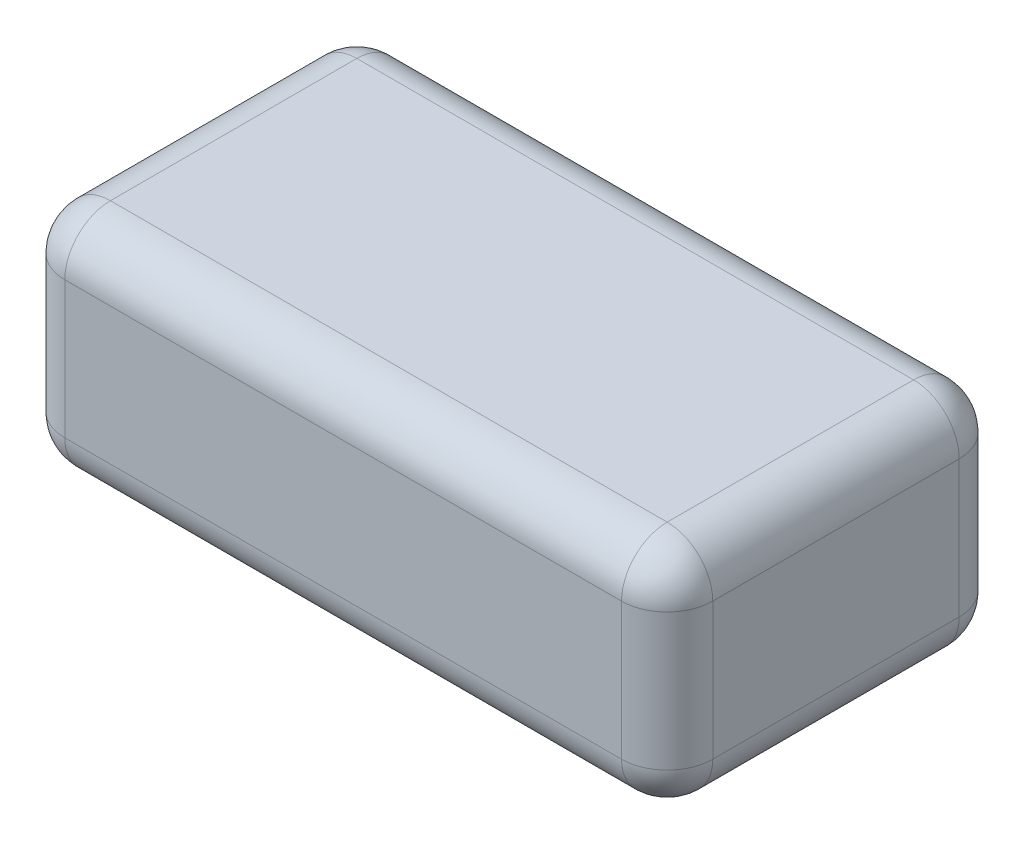
ISO-10303-21;
HEADER;
FILE_DESCRIPTION(('STEP AP214'),'2;1');
FILE_NAME('part.step','',(''),(''),'','','');
FILE_SCHEMA(('AUTOMOTIVE_DESIGN { 1 0 10303 214 1 1 1 1 }'));
ENDSEC;
DATA;
#1=APPLICATION_CONTEXT('core data for automotive mechanical design processes');
#2=APPLICATION_PROTOCOL_DEFINITION('international standard','automotive_design',2000,#1);
#3=PRODUCT_CONTEXT('',#1,'mechanical');
#4=PRODUCT('Part','Part','',(#3));
#5=PRODUCT_RELATED_PRODUCT_CATEGORY('part','',(#4));
#6=PRODUCT_DEFINITION_FORMATION('','',#4);
#7=PRODUCT_DEFINITION_CONTEXT('part definition',#1,'design');
#8=PRODUCT_DEFINITION('design','',#6,#7);
#9=PRODUCT_DEFINITION_SHAPE('','',#8);
#10=(LENGTH_UNIT() NAMED_UNIT(*) SI_UNIT(.MILLI.,.METRE.));
#11=(NAMED_UNIT(*) PLANE_ANGLE_UNIT() SI_UNIT($,.RADIAN.));
#12=(NAMED_UNIT(*) SI_UNIT($,.STERADIAN.) SOLID_ANGLE_UNIT());
#13=UNCERTAINTY_MEASURE_WITH_UNIT(LENGTH_MEASURE(1.E-05),#10,'distance_accuracy_value','');
#14=(GEOMETRIC_REPRESENTATION_CONTEXT(3) GLOBAL_UNCERTAINTY_ASSIGNED_CONTEXT((#13)) GLOBAL_UNIT_ASSIGNED_CONTEXT((#10,
#11,#12)) REPRESENTATION_CONTEXT('',''));
#15=CARTESIAN_POINT('',(0.,0.,0.));
#16=DIRECTION('',(0.,0.,1.));
#17=DIRECTION('',(1.,0.,0.));
#18=AXIS2_PLACEMENT_3D('',#15,#16,#17);
#19=CARTESIAN_POINT('',(35.5,25.,18.5));
#20=DIRECTION('',(-1.,0.,0.));
#21=DIRECTION('',(0.,0.,1.));
#22=AXIS2_PLACEMENT_3D('',#19,#20,#21);
#23=PLANE('',#22);
#24=DIRECTION('',(0.,0.,-1.));
#25=VECTOR('',#24,1.);
#26=CARTESIAN_POINT('',(35.5,20.,18.5));
#27=LINE('',#26,#25);
#28=CARTESIAN_POINT('',(35.5,20.,-13.5));
#29=VERTEX_POINT('',#28);
#30=CARTESIAN_POINT('',(35.5,20.,13.5));
#31=VERTEX_POINT('',#30);
#32=EDGE_CURVE('E175',#29,#31,#27,.F.);
#33=ORIENTED_EDGE('',*,*,#32,.T.);
#34=DIRECTION('',(0.,-1.,0.));
#35=VECTOR('',#34,1.);
#36=CARTESIAN_POINT('',(35.5,25.,13.5));
#37=LINE('',#36,#35);
#38=CARTESIAN_POINT('',(35.5,5.,13.5));
#39=VERTEX_POINT('',#38);
#40=EDGE_CURVE('E179',#31,#39,#37,.T.);
#41=ORIENTED_EDGE('',*,*,#40,.T.);
#42=DIRECTION('',(0.,0.,-1.));
#43=VECTOR('',#42,1.);
#44=CARTESIAN_POINT('',(35.5,5.,-18.5));
#45=LINE('',#44,#43);
#46=CARTESIAN_POINT('',(35.5,5.,-13.5));
#47=VERTEX_POINT('',#46);
#48=EDGE_CURVE('E177',#39,#47,#45,.T.);
#49=ORIENTED_EDGE('',*,*,#48,.T.);
#50=DIRECTION('',(0.,-1.,0.));
#51=VECTOR('',#50,1.);
#52=CARTESIAN_POINT('',(35.5,25.,-13.5));
#53=LINE('',#52,#51);
#54=EDGE_CURVE('E173',#47,#29,#53,.F.);
#55=ORIENTED_EDGE('',*,*,#54,.T.);
#56=EDGE_LOOP('',(#33,#41,#49,#55));
#57=FACE_BOUND('',#56,.T.);
#58=ADVANCED_FACE('F32',(#57),#23,.F.);
#59=CARTESIAN_POINT('',(-35.5,25.,-18.5));
#60=DIRECTION('',(0.,0.,1.));
#61=DIRECTION('',(1.,0.,0.));
#62=AXIS2_PLACEMENT_3D('',#59,#60,#61);
#63=PLANE('',#62);
#64=DIRECTION('',(-1.,0.,0.));
#65=VECTOR('',#64,1.);
#66=CARTESIAN_POINT('',(-35.5,20.,-18.5));
#67=LINE('',#66,#65);
#68=CARTESIAN_POINT('',(-30.5,20.,-18.5));
#69=VERTEX_POINT('',#68);
#70=CARTESIAN_POINT('',(30.5,20.,-18.5));
#71=VERTEX_POINT('',#70);
#72=EDGE_CURVE('E41',#69,#71,#67,.F.);
#73=ORIENTED_EDGE('',*,*,#72,.T.);
#74=DIRECTION('',(0.,-1.,0.));
#75=VECTOR('',#74,1.);
#76=CARTESIAN_POINT('',(30.5,25.,-18.5));
#77=LINE('',#76,#75);
#78=CARTESIAN_POINT('',(30.5,5.,-18.5));
#79=VERTEX_POINT('',#78);
#80=EDGE_CURVE('E11',#71,#79,#77,.T.);
#81=ORIENTED_EDGE('',*,*,#80,.T.);
#82=DIRECTION('',(-1.,0.,0.));
#83=VECTOR('',#82,1.);
#84=CARTESIAN_POINT('',(-35.5,5.,-18.5));
#85=LINE('',#84,#83);
#86=CARTESIAN_POINT('',(-30.5,5.,-18.5));
#87=VERTEX_POINT('',#86);
#88=EDGE_CURVE('E198',#79,#87,#85,.T.);
#89=ORIENTED_EDGE('',*,*,#88,.T.);
#90=DIRECTION('',(0.,-1.,0.));
#91=VECTOR('',#90,1.);
#92=CARTESIAN_POINT('',(-30.5,25.,-18.5));
#93=LINE('',#92,#91);
#94=EDGE_CURVE('E52',#87,#69,#93,.F.);
#95=ORIENTED_EDGE('',*,*,#94,.T.);
#96=EDGE_LOOP('',(#73,#81,#89,#95));
#97=FACE_BOUND('',#96,.T.);
#98=ADVANCED_FACE('F270',(#97),#63,.F.);
#99=CARTESIAN_POINT('',(-35.5,25.,18.5));
#100=DIRECTION('',(1.,0.,0.));
#101=DIRECTION('',(0.,0.,-1.));
#102=AXIS2_PLACEMENT_3D('',#99,#100,#101);
#103=PLANE('',#102);
#104=DIRECTION('',(0.,-1.,0.));
#105=VECTOR('',#104,1.);
#106=CARTESIAN_POINT('',(-35.5,25.,13.5));
#107=LINE('',#106,#105);
#108=CARTESIAN_POINT('',(-35.5,5.,13.5));
#109=VERTEX_POINT('',#108);
#110=CARTESIAN_POINT('',(-35.5,20.,13.5));
#111=VERTEX_POINT('',#110);
#112=EDGE_CURVE('E193',#109,#111,#107,.F.);
#113=ORIENTED_EDGE('',*,*,#112,.T.);
#114=DIRECTION('',(0.,0.,1.));
#115=VECTOR('',#114,1.);
#116=CARTESIAN_POINT('',(-35.5,20.,18.5));
#117=LINE('',#116,#115);
#118=CARTESIAN_POINT('',(-35.5,20.,-13.5));
#119=VERTEX_POINT('',#118);
#120=EDGE_CURVE('E195',#111,#119,#117,.F.);
#121=ORIENTED_EDGE('',*,*,#120,.T.);
#122=DIRECTION('',(0.,-1.,0.));
#123=VECTOR('',#122,1.);
#124=CARTESIAN_POINT('',(-35.5,25.,-13.5));
#125=LINE('',#124,#123);
#126=CARTESIAN_POINT('',(-35.5,5.,-13.5));
#127=VERTEX_POINT('',#126);
#128=EDGE_CURVE('E189',#119,#127,#125,.T.);
#129=ORIENTED_EDGE('',*,*,#128,.T.);
#130=DIRECTION('',(0.,0.,1.));
#131=VECTOR('',#130,1.);
#132=CARTESIAN_POINT('',(-35.5,5.,18.5));
#133=LINE('',#132,#131);
#134=EDGE_CURVE('E191',#127,#109,#133,.T.);
#135=ORIENTED_EDGE('',*,*,#134,.T.);
#136=EDGE_LOOP('',(#113,#121,#129,#135));
#137=FACE_BOUND('',#136,.T.);
#138=ADVANCED_FACE('F289',(#137),#103,.F.);
#139=CARTESIAN_POINT('',(-35.5,25.,18.5));
#140=DIRECTION('',(0.,0.,-1.));
#141=DIRECTION('',(-1.,0.,0.));
#142=AXIS2_PLACEMENT_3D('',#139,#140,#141);
#143=PLANE('',#142);
#144=DIRECTION('',(0.,-1.,0.));
#145=VECTOR('',#144,1.);
#146=CARTESIAN_POINT('',(-30.5,25.,18.5));
#147=LINE('',#146,#145);
#148=CARTESIAN_POINT('',(-30.5,20.,18.5));
#149=VERTEX_POINT('',#148);
#150=CARTESIAN_POINT('',(-30.5,5.,18.5));
#151=VERTEX_POINT('',#150);
#152=EDGE_CURVE('E124',#149,#151,#147,.T.);
#153=ORIENTED_EDGE('',*,*,#152,.T.);
#154=DIRECTION('',(1.,0.,0.));
#155=VECTOR('',#154,1.);
#156=CARTESIAN_POINT('',(35.5,5.,18.5));
#157=LINE('',#156,#155);
#158=CARTESIAN_POINT('',(30.5,5.,18.5));
#159=VERTEX_POINT('',#158);
#160=EDGE_CURVE('E162',#151,#159,#157,.T.);
#161=ORIENTED_EDGE('',*,*,#160,.T.);
#162=DIRECTION('',(0.,-1.,0.));
#163=VECTOR('',#162,1.);
#164=CARTESIAN_POINT('',(30.5,25.,18.5));
#165=LINE('',#164,#163);
#166=CARTESIAN_POINT('',(30.5,20.,18.5));
#167=VERTEX_POINT('',#166);
#168=EDGE_CURVE('E127',#159,#167,#165,.F.);
#169=ORIENTED_EDGE('',*,*,#168,.T.);
#170=DIRECTION('',(1.,0.,0.));
#171=VECTOR('',#170,1.);
#172=CARTESIAN_POINT('',(-35.5,20.,18.5));
#173=LINE('',#172,#171);
#174=EDGE_CURVE('E119',#167,#149,#173,.F.);
#175=ORIENTED_EDGE('',*,*,#174,.T.);
#176=EDGE_LOOP('',(#153,#161,#169,#175));
#177=FACE_BOUND('',#176,.T.);
#178=ADVANCED_FACE('F121',(#177),#143,.F.);
#179=CARTESIAN_POINT('',(0.,25.,0.));
#180=DIRECTION('',(0.,-1.,0.));
#181=DIRECTION('',(0.,0.,-1.));
#182=AXIS2_PLACEMENT_3D('',#179,#180,#181);
#183=PLANE('',#182);
#184=DIRECTION('',(0.,0.,1.));
#185=VECTOR('',#184,1.);
#186=CARTESIAN_POINT('',(-30.5,25.,0.));
#187=LINE('',#186,#185);
#188=CARTESIAN_POINT('',(-30.5,25.,-13.5));
#189=VERTEX_POINT('',#188);
#190=CARTESIAN_POINT('',(-30.5,25.,13.5));
#191=VERTEX_POINT('',#190);
#192=EDGE_CURVE('E184',#189,#191,#187,.T.);
#193=ORIENTED_EDGE('',*,*,#192,.T.);
#194=DIRECTION('',(1.,0.,0.));
#195=VECTOR('',#194,1.);
#196=CARTESIAN_POINT('',(0.,25.,13.5));
#197=LINE('',#196,#195);
#198=CARTESIAN_POINT('',(30.5,25.,13.5));
#199=VERTEX_POINT('',#198);
#200=EDGE_CURVE('E138',#191,#199,#197,.T.);
#201=ORIENTED_EDGE('',*,*,#200,.T.);
#202=DIRECTION('',(0.,0.,-1.));
#203=VECTOR('',#202,1.);
#204=CARTESIAN_POINT('',(30.5,25.,0.));
#205=LINE('',#204,#203);
#206=CARTESIAN_POINT('',(30.5,25.,-13.5));
#207=VERTEX_POINT('',#206);
#208=EDGE_CURVE('E186',#199,#207,#205,.T.);
#209=ORIENTED_EDGE('',*,*,#208,.T.);
#210=DIRECTION('',(-1.,0.,0.));
#211=VECTOR('',#210,1.);
#212=CARTESIAN_POINT('',(0.,25.,-13.5));
#213=LINE('',#212,#211);
#214=EDGE_CURVE('E182',#207,#189,#213,.T.);
#215=ORIENTED_EDGE('',*,*,#214,.T.);
#216=EDGE_LOOP('',(#193,#201,#209,#215));
#217=FACE_BOUND('',#216,.T.);
#218=ADVANCED_FACE('F299',(#217),#183,.F.);
#219=CARTESIAN_POINT('',(0.,0.,0.));
#220=DIRECTION('',(0.,-1.,0.));
#221=DIRECTION('',(0.,0.,-1.));
#222=AXIS2_PLACEMENT_3D('',#219,#220,#221);
#223=PLANE('',#222);
#224=DIRECTION('',(0.,0.,-1.));
#225=VECTOR('',#224,1.);
#226=CARTESIAN_POINT('',(30.5,0.,18.5));
#227=LINE('',#226,#225);
#228=CARTESIAN_POINT('',(30.5,0.,-13.5));
#229=VERTEX_POINT('',#228);
#230=CARTESIAN_POINT('',(30.5,0.,13.5));
#231=VERTEX_POINT('',#230);
#232=EDGE_CURVE('E168',#229,#231,#227,.F.);
#233=ORIENTED_EDGE('',*,*,#232,.T.);
#234=DIRECTION('',(1.,0.,0.));
#235=VECTOR('',#234,1.);
#236=CARTESIAN_POINT('',(-35.5,0.,13.5));
#237=LINE('',#236,#235);
#238=CARTESIAN_POINT('',(-30.5,0.,13.5));
#239=VERTEX_POINT('',#238);
#240=EDGE_CURVE('E170',#231,#239,#237,.F.);
#241=ORIENTED_EDGE('',*,*,#240,.T.);
#242=DIRECTION('',(0.,0.,1.));
#243=VECTOR('',#242,1.);
#244=CARTESIAN_POINT('',(-30.5,0.,-18.5));
#245=LINE('',#244,#243);
#246=CARTESIAN_POINT('',(-30.5,0.,-13.5));
#247=VERTEX_POINT('',#246);
#248=EDGE_CURVE('E166',#239,#247,#245,.F.);
#249=ORIENTED_EDGE('',*,*,#248,.T.);
#250=DIRECTION('',(-1.,0.,0.));
#251=VECTOR('',#250,1.);
#252=CARTESIAN_POINT('',(35.5,0.,-13.5));
#253=LINE('',#252,#251);
#254=EDGE_CURVE('E164',#247,#229,#253,.F.);
#255=ORIENTED_EDGE('',*,*,#254,.T.);
#256=EDGE_LOOP('',(#233,#241,#249,#255));
#257=FACE_BOUND('',#256,.T.);
#258=ADVANCED_FACE('F301',(#257),#223,.T.);
#259=CARTESIAN_POINT('',(0.,20.,-13.5));
#260=DIRECTION('',(-1.,0.,0.));
#261=DIRECTION('',(0.,0.,1.));
#262=AXIS2_PLACEMENT_3D('',#259,#260,#261);
#263=CYLINDRICAL_SURFACE('',#262,5.);
#264=CARTESIAN_POINT('',(-30.5,20.,-13.5));
#265=DIRECTION('',(-1.,0.,0.));
#266=DIRECTION('',(0.,0.,1.));
#267=AXIS2_PLACEMENT_3D('',#264,#265,#266);
#268=CIRCLE('',#267,5.);
#269=EDGE_CURVE('E36',#189,#69,#268,.T.);
#270=ORIENTED_EDGE('',*,*,#269,.F.);
#271=ORIENTED_EDGE('',*,*,#214,.F.);
#272=CARTESIAN_POINT('',(30.5,20.,-13.5));
#273=DIRECTION('',(1.,0.,0.));
#274=DIRECTION('',(0.,1.,0.));
#275=AXIS2_PLACEMENT_3D('',#272,#273,#274);
#276=CIRCLE('',#275,5.);
#277=EDGE_CURVE('E159',#71,#207,#276,.T.);
#278=ORIENTED_EDGE('',*,*,#277,.F.);
#279=ORIENTED_EDGE('',*,*,#72,.F.);
#280=EDGE_LOOP('',(#270,#271,#278,#279));
#281=FACE_BOUND('',#280,.T.);
#282=ADVANCED_FACE('F34',(#281),#263,.T.);
#283=CARTESIAN_POINT('',(-30.5,20.,-13.5));
#284=DIRECTION('',(0.,0.,1.));
#285=DIRECTION('',(1.,0.,0.));
#286=AXIS2_PLACEMENT_3D('',#283,#284,#285);
#287=SPHERICAL_SURFACE('',#286,5.);
#288=CARTESIAN_POINT('',(-30.5,20.,-13.5));
#289=DIRECTION('',(0.,0.,-1.));
#290=DIRECTION('',(0.,1.,0.));
#291=AXIS2_PLACEMENT_3D('',#288,#289,#290);
#292=CIRCLE('',#291,5.);
#293=EDGE_CURVE('E243',#189,#119,#292,.F.);
#294=ORIENTED_EDGE('',*,*,#293,.F.);
#295=ORIENTED_EDGE('',*,*,#269,.T.);
#296=CARTESIAN_POINT('',(-30.5,20.,-13.5));
#297=DIRECTION('',(0.,1.,0.));
#298=DIRECTION('',(0.,0.,1.));
#299=AXIS2_PLACEMENT_3D('',#296,#297,#298);
#300=CIRCLE('',#299,5.);
#301=EDGE_CURVE('E246',#119,#69,#300,.F.);
#302=ORIENTED_EDGE('',*,*,#301,.F.);
#303=EDGE_LOOP('',(#294,#295,#302));
#304=FACE_BOUND('',#303,.T.);
#305=ADVANCED_FACE('F293',(#304),#287,.T.);
#306=CARTESIAN_POINT('',(30.5,20.,-13.5));
#307=DIRECTION('',(0.,0.,1.));
#308=DIRECTION('',(1.,0.,0.));
#309=AXIS2_PLACEMENT_3D('',#306,#307,#308);
#310=SPHERICAL_SURFACE('',#309,5.);
#311=CARTESIAN_POINT('',(30.5,20.,-13.5));
#312=DIRECTION('',(0.,1.,0.));
#313=DIRECTION('',(0.,0.,1.));
#314=AXIS2_PLACEMENT_3D('',#311,#312,#313);
#315=CIRCLE('',#314,5.);
#316=EDGE_CURVE('E237',#71,#29,#315,.F.);
#317=ORIENTED_EDGE('',*,*,#316,.F.);
#318=ORIENTED_EDGE('',*,*,#277,.T.);
#319=CARTESIAN_POINT('',(30.5,20.,-13.5));
#320=DIRECTION('',(0.,0.,-1.));
#321=DIRECTION('',(-1.,0.,0.));
#322=AXIS2_PLACEMENT_3D('',#319,#320,#321);
#323=CIRCLE('',#322,5.);
#324=EDGE_CURVE('E240',#29,#207,#323,.F.);
#325=ORIENTED_EDGE('',*,*,#324,.F.);
#326=EDGE_LOOP('',(#317,#318,#325));
#327=FACE_BOUND('',#326,.T.);
#328=ADVANCED_FACE('F252',(#327),#310,.T.);
#329=CARTESIAN_POINT('',(-30.5,25.,-13.5));
#330=DIRECTION('',(0.,-1.,0.));
#331=DIRECTION('',(0.,0.,-1.));
#332=AXIS2_PLACEMENT_3D('',#329,#330,#331);
#333=CYLINDRICAL_SURFACE('',#332,5.);
#334=ORIENTED_EDGE('',*,*,#301,.T.);
#335=ORIENTED_EDGE('',*,*,#94,.F.);
#336=CARTESIAN_POINT('',(-30.5,5.,-13.5));
#337=DIRECTION('',(0.,-1.,0.));
#338=DIRECTION('',(0.,0.,-1.));
#339=AXIS2_PLACEMENT_3D('',#336,#337,#338);
#340=CIRCLE('',#339,5.);
#341=EDGE_CURVE('E231',#127,#87,#340,.T.);
#342=ORIENTED_EDGE('',*,*,#341,.F.);
#343=ORIENTED_EDGE('',*,*,#128,.F.);
#344=EDGE_LOOP('',(#334,#335,#342,#343));
#345=FACE_BOUND('',#344,.T.);
#346=ADVANCED_FACE('F276',(#345),#333,.T.);
#347=CARTESIAN_POINT('',(-30.5,20.,0.));
#348=DIRECTION('',(0.,0.,1.));
#349=DIRECTION('',(1.,0.,0.));
#350=AXIS2_PLACEMENT_3D('',#347,#348,#349);
#351=CYLINDRICAL_SURFACE('',#350,5.);
#352=ORIENTED_EDGE('',*,*,#293,.T.);
#353=ORIENTED_EDGE('',*,*,#120,.F.);
#354=CARTESIAN_POINT('',(-30.5,20.,13.5));
#355=DIRECTION('',(0.,0.,1.));
#356=DIRECTION('',(1.,0.,0.));
#357=AXIS2_PLACEMENT_3D('',#354,#355,#356);
#358=CIRCLE('',#357,5.);
#359=EDGE_CURVE('E142',#191,#111,#358,.T.);
#360=ORIENTED_EDGE('',*,*,#359,.F.);
#361=ORIENTED_EDGE('',*,*,#192,.F.);
#362=EDGE_LOOP('',(#352,#353,#360,#361));
#363=FACE_BOUND('',#362,.T.);
#364=ADVANCED_FACE('F297',(#363),#351,.T.);
#365=CARTESIAN_POINT('',(0.,20.,13.5));
#366=DIRECTION('',(1.,0.,0.));
#367=DIRECTION('',(0.,0.,-1.));
#368=AXIS2_PLACEMENT_3D('',#365,#366,#367);
#369=CYLINDRICAL_SURFACE('',#368,5.);
#370=CARTESIAN_POINT('',(30.5,20.,13.5));
#371=DIRECTION('',(1.,0.,0.));
#372=DIRECTION('',(0.,0.,-1.));
#373=AXIS2_PLACEMENT_3D('',#370,#371,#372);
#374=CIRCLE('',#373,5.);
#375=EDGE_CURVE('E143',#199,#167,#374,.T.);
#376=ORIENTED_EDGE('',*,*,#375,.F.);
#377=ORIENTED_EDGE('',*,*,#200,.F.);
#378=CARTESIAN_POINT('',(-30.5,20.,13.5));
#379=DIRECTION('',(-1.,0.,0.));
#380=DIRECTION('',(0.,0.,1.));
#381=AXIS2_PLACEMENT_3D('',#378,#379,#380);
#382=CIRCLE('',#381,5.);
#383=EDGE_CURVE('E134',#149,#191,#382,.T.);
#384=ORIENTED_EDGE('',*,*,#383,.F.);
#385=ORIENTED_EDGE('',*,*,#174,.F.);
#386=EDGE_LOOP('',(#376,#377,#384,#385));
#387=FACE_BOUND('',#386,.T.);
#388=ADVANCED_FACE('F136',(#387),#369,.T.);
#389=CARTESIAN_POINT('',(30.5,20.,0.));
#390=DIRECTION('',(0.,0.,-1.));
#391=DIRECTION('',(-1.,0.,0.));
#392=AXIS2_PLACEMENT_3D('',#389,#390,#391);
#393=CYLINDRICAL_SURFACE('',#392,5.);
#394=ORIENTED_EDGE('',*,*,#324,.T.);
#395=ORIENTED_EDGE('',*,*,#208,.F.);
#396=CARTESIAN_POINT('',(30.5,20.,13.5));
#397=DIRECTION('',(0.,0.,1.));
#398=DIRECTION('',(1.,0.,0.));
#399=AXIS2_PLACEMENT_3D('',#396,#397,#398);
#400=CIRCLE('',#399,5.);
#401=EDGE_CURVE('E227',#31,#199,#400,.T.);
#402=ORIENTED_EDGE('',*,*,#401,.F.);
#403=ORIENTED_EDGE('',*,*,#32,.F.);
#404=EDGE_LOOP('',(#394,#395,#402,#403));
#405=FACE_BOUND('',#404,.T.);
#406=ADVANCED_FACE('F259',(#405),#393,.T.);
#407=CARTESIAN_POINT('',(30.5,25.,-13.5));
#408=DIRECTION('',(0.,-1.,0.));
#409=DIRECTION('',(0.,0.,-1.));
#410=AXIS2_PLACEMENT_3D('',#407,#408,#409);
#411=CYLINDRICAL_SURFACE('',#410,5.);
#412=ORIENTED_EDGE('',*,*,#316,.T.);
#413=ORIENTED_EDGE('',*,*,#54,.F.);
#414=CARTESIAN_POINT('',(30.5,5.,-13.5));
#415=DIRECTION('',(0.,-1.,0.));
#416=DIRECTION('',(0.,0.,-1.));
#417=AXIS2_PLACEMENT_3D('',#414,#415,#416);
#418=CIRCLE('',#417,5.);
#419=EDGE_CURVE('E224',#79,#47,#418,.T.);
#420=ORIENTED_EDGE('',*,*,#419,.F.);
#421=ORIENTED_EDGE('',*,*,#80,.F.);
#422=EDGE_LOOP('',(#412,#413,#420,#421));
#423=FACE_BOUND('',#422,.T.);
#424=ADVANCED_FACE('F268',(#423),#411,.T.);
#425=CARTESIAN_POINT('',(-35.5,5.,-13.5));
#426=DIRECTION('',(1.,0.,0.));
#427=DIRECTION('',(0.,0.,-1.));
#428=AXIS2_PLACEMENT_3D('',#425,#426,#427);
#429=CYLINDRICAL_SURFACE('',#428,5.);
#430=CARTESIAN_POINT('',(-30.5,5.,-13.5));
#431=DIRECTION('',(-1.,0.,0.));
#432=DIRECTION('',(0.,0.,1.));
#433=AXIS2_PLACEMENT_3D('',#430,#431,#432);
#434=CIRCLE('',#433,5.);
#435=EDGE_CURVE('E234',#87,#247,#434,.T.);
#436=ORIENTED_EDGE('',*,*,#435,.F.);
#437=ORIENTED_EDGE('',*,*,#88,.F.);
#438=CARTESIAN_POINT('',(30.5,5.,-13.5));
#439=DIRECTION('',(1.,0.,0.));
#440=DIRECTION('',(0.,0.,-1.));
#441=AXIS2_PLACEMENT_3D('',#438,#439,#440);
#442=CIRCLE('',#441,5.);
#443=EDGE_CURVE('E222',#229,#79,#442,.T.);
#444=ORIENTED_EDGE('',*,*,#443,.F.);
#445=ORIENTED_EDGE('',*,*,#254,.F.);
#446=EDGE_LOOP('',(#436,#437,#444,#445));
#447=FACE_BOUND('',#446,.T.);
#448=ADVANCED_FACE('F280',(#447),#429,.T.);
#449=CARTESIAN_POINT('',(-30.5,5.,-13.5));
#450=DIRECTION('',(0.,0.,1.));
#451=DIRECTION('',(1.,0.,0.));
#452=AXIS2_PLACEMENT_3D('',#449,#450,#451);
#453=SPHERICAL_SURFACE('',#452,5.);
#454=ORIENTED_EDGE('',*,*,#341,.T.);
#455=ORIENTED_EDGE('',*,*,#435,.T.);
#456=CARTESIAN_POINT('',(-30.5,5.,-13.5));
#457=DIRECTION('',(0.,0.,-1.));
#458=DIRECTION('',(-1.,0.,0.));
#459=AXIS2_PLACEMENT_3D('',#456,#457,#458);
#460=CIRCLE('',#459,5.);
#461=EDGE_CURVE('E150',#127,#247,#460,.F.);
#462=ORIENTED_EDGE('',*,*,#461,.F.);
#463=EDGE_LOOP('',(#454,#455,#462));
#464=FACE_BOUND('',#463,.T.);
#465=ADVANCED_FACE('F282',(#464),#453,.T.);
#466=CARTESIAN_POINT('',(-30.5,20.,13.5));
#467=DIRECTION('',(0.,0.,1.));
#468=DIRECTION('',(1.,0.,0.));
#469=AXIS2_PLACEMENT_3D('',#466,#467,#468);
#470=SPHERICAL_SURFACE('',#469,5.);
#471=ORIENTED_EDGE('',*,*,#383,.T.);
#472=ORIENTED_EDGE('',*,*,#359,.T.);
#473=CARTESIAN_POINT('',(-30.5,20.,13.5));
#474=DIRECTION('',(0.,1.,0.));
#475=DIRECTION('',(0.,0.,1.));
#476=AXIS2_PLACEMENT_3D('',#473,#474,#475);
#477=CIRCLE('',#476,5.);
#478=EDGE_CURVE('E146',#149,#111,#477,.F.);
#479=ORIENTED_EDGE('',*,*,#478,.F.);
#480=EDGE_LOOP('',(#471,#472,#479));
#481=FACE_BOUND('',#480,.T.);
#482=ADVANCED_FACE('F147',(#481),#470,.T.);
#483=CARTESIAN_POINT('',(30.5,20.,13.5));
#484=DIRECTION('',(0.,0.,1.));
#485=DIRECTION('',(1.,0.,0.));
#486=AXIS2_PLACEMENT_3D('',#483,#484,#485);
#487=SPHERICAL_SURFACE('',#486,5.);
#488=ORIENTED_EDGE('',*,*,#401,.T.);
#489=ORIENTED_EDGE('',*,*,#375,.T.);
#490=CARTESIAN_POINT('',(30.5,20.,13.5));
#491=DIRECTION('',(0.,1.,0.));
#492=DIRECTION('',(0.,0.,1.));
#493=AXIS2_PLACEMENT_3D('',#490,#491,#492);
#494=CIRCLE('',#493,5.);
#495=EDGE_CURVE('E151',#31,#167,#494,.F.);
#496=ORIENTED_EDGE('',*,*,#495,.F.);
#497=EDGE_LOOP('',(#488,#489,#496));
#498=FACE_BOUND('',#497,.T.);
#499=ADVANCED_FACE('F343',(#498),#487,.T.);
#500=CARTESIAN_POINT('',(30.5,5.,-13.5));
#501=DIRECTION('',(0.,0.,1.));
#502=DIRECTION('',(1.,0.,0.));
#503=AXIS2_PLACEMENT_3D('',#500,#501,#502);
#504=SPHERICAL_SURFACE('',#503,5.);
#505=ORIENTED_EDGE('',*,*,#443,.T.);
#506=ORIENTED_EDGE('',*,*,#419,.T.);
#507=CARTESIAN_POINT('',(30.5,5.,-13.5));
#508=DIRECTION('',(0.,0.,-1.));
#509=DIRECTION('',(-1.,0.,0.));
#510=AXIS2_PLACEMENT_3D('',#507,#508,#509);
#511=CIRCLE('',#510,5.);
#512=EDGE_CURVE('E215',#229,#47,#511,.F.);
#513=ORIENTED_EDGE('',*,*,#512,.F.);
#514=EDGE_LOOP('',(#505,#506,#513));
#515=FACE_BOUND('',#514,.T.);
#516=ADVANCED_FACE('F340',(#515),#504,.T.);
#517=CARTESIAN_POINT('',(-30.5,5.,18.5));
#518=DIRECTION('',(0.,0.,-1.));
#519=DIRECTION('',(-1.,0.,0.));
#520=AXIS2_PLACEMENT_3D('',#517,#518,#519);
#521=CYLINDRICAL_SURFACE('',#520,5.);
#522=ORIENTED_EDGE('',*,*,#461,.T.);
#523=ORIENTED_EDGE('',*,*,#248,.F.);
#524=CARTESIAN_POINT('',(-30.5,5.,13.5));
#525=DIRECTION('',(0.,0.,1.));
#526=DIRECTION('',(1.,0.,0.));
#527=AXIS2_PLACEMENT_3D('',#524,#525,#526);
#528=CIRCLE('',#527,5.);
#529=EDGE_CURVE('E212',#109,#239,#528,.T.);
#530=ORIENTED_EDGE('',*,*,#529,.F.);
#531=ORIENTED_EDGE('',*,*,#134,.F.);
#532=EDGE_LOOP('',(#522,#523,#530,#531));
#533=FACE_BOUND('',#532,.T.);
#534=ADVANCED_FACE('F287',(#533),#521,.T.);
#535=CARTESIAN_POINT('',(-30.5,25.,13.5));
#536=DIRECTION('',(0.,-1.,0.));
#537=DIRECTION('',(0.,0.,-1.));
#538=AXIS2_PLACEMENT_3D('',#535,#536,#537);
#539=CYLINDRICAL_SURFACE('',#538,5.);
#540=ORIENTED_EDGE('',*,*,#478,.T.);
#541=ORIENTED_EDGE('',*,*,#112,.F.);
#542=CARTESIAN_POINT('',(-30.5,5.,13.5));
#543=DIRECTION('',(0.,-1.,0.));
#544=DIRECTION('',(0.,0.,-1.));
#545=AXIS2_PLACEMENT_3D('',#542,#543,#544);
#546=CIRCLE('',#545,5.);
#547=EDGE_CURVE('E155',#151,#109,#546,.T.);
#548=ORIENTED_EDGE('',*,*,#547,.F.);
#549=ORIENTED_EDGE('',*,*,#152,.F.);
#550=EDGE_LOOP('',(#540,#541,#548,#549));
#551=FACE_BOUND('',#550,.T.);
#552=ADVANCED_FACE('F153',(#551),#539,.T.);
#553=CARTESIAN_POINT('',(30.5,25.,13.5));
#554=DIRECTION('',(0.,-1.,0.));
#555=DIRECTION('',(0.,0.,-1.));
#556=AXIS2_PLACEMENT_3D('',#553,#554,#555);
#557=CYLINDRICAL_SURFACE('',#556,5.);
#558=ORIENTED_EDGE('',*,*,#495,.T.);
#559=ORIENTED_EDGE('',*,*,#168,.F.);
#560=CARTESIAN_POINT('',(30.5,5.,13.5));
#561=DIRECTION('',(0.,-1.,0.));
#562=DIRECTION('',(0.,0.,-1.));
#563=AXIS2_PLACEMENT_3D('',#560,#561,#562);
#564=CIRCLE('',#563,5.);
#565=EDGE_CURVE('E208',#39,#159,#564,.T.);
#566=ORIENTED_EDGE('',*,*,#565,.F.);
#567=ORIENTED_EDGE('',*,*,#40,.F.);
#568=EDGE_LOOP('',(#558,#559,#566,#567));
#569=FACE_BOUND('',#568,.T.);
#570=ADVANCED_FACE('F331',(#569),#557,.T.);
#571=CARTESIAN_POINT('',(30.5,5.,18.5));
#572=DIRECTION('',(0.,0.,1.));
#573=DIRECTION('',(1.,0.,0.));
#574=AXIS2_PLACEMENT_3D('',#571,#572,#573);
#575=CYLINDRICAL_SURFACE('',#574,5.);
#576=ORIENTED_EDGE('',*,*,#512,.T.);
#577=ORIENTED_EDGE('',*,*,#48,.F.);
#578=CARTESIAN_POINT('',(30.5,5.,13.5));
#579=DIRECTION('',(0.,0.,1.));
#580=DIRECTION('',(1.,0.,0.));
#581=AXIS2_PLACEMENT_3D('',#578,#579,#580);
#582=CIRCLE('',#581,5.);
#583=EDGE_CURVE('E206',#231,#39,#582,.T.);
#584=ORIENTED_EDGE('',*,*,#583,.F.);
#585=ORIENTED_EDGE('',*,*,#232,.F.);
#586=EDGE_LOOP('',(#576,#577,#584,#585));
#587=FACE_BOUND('',#586,.T.);
#588=ADVANCED_FACE('F327',(#587),#575,.T.);
#589=CARTESIAN_POINT('',(-30.5,5.,13.5));
#590=DIRECTION('',(0.,0.,1.));
#591=DIRECTION('',(1.,0.,0.));
#592=AXIS2_PLACEMENT_3D('',#589,#590,#591);
#593=SPHERICAL_SURFACE('',#592,5.);
#594=ORIENTED_EDGE('',*,*,#547,.T.);
#595=ORIENTED_EDGE('',*,*,#529,.T.);
#596=CARTESIAN_POINT('',(-30.5,5.,13.5));
#597=DIRECTION('',(-1.,0.,0.));
#598=DIRECTION('',(0.,0.,1.));
#599=AXIS2_PLACEMENT_3D('',#596,#597,#598);
#600=CIRCLE('',#599,5.);
#601=EDGE_CURVE('E204',#151,#239,#600,.F.);
#602=ORIENTED_EDGE('',*,*,#601,.F.);
#603=EDGE_LOOP('',(#594,#595,#602));
#604=FACE_BOUND('',#603,.T.);
#605=ADVANCED_FACE('F323',(#604),#593,.T.);
#606=CARTESIAN_POINT('',(30.5,5.,13.5));
#607=DIRECTION('',(0.,0.,1.));
#608=DIRECTION('',(1.,0.,0.));
#609=AXIS2_PLACEMENT_3D('',#606,#607,#608);
#610=SPHERICAL_SURFACE('',#609,5.);
#611=ORIENTED_EDGE('',*,*,#583,.T.);
#612=ORIENTED_EDGE('',*,*,#565,.T.);
#613=CARTESIAN_POINT('',(30.5,5.,13.5));
#614=DIRECTION('',(1.,0.,0.));
#615=DIRECTION('',(0.,0.,-1.));
#616=AXIS2_PLACEMENT_3D('',#613,#614,#615);
#617=CIRCLE('',#616,5.);
#618=EDGE_CURVE('E202',#231,#159,#617,.F.);
#619=ORIENTED_EDGE('',*,*,#618,.F.);
#620=EDGE_LOOP('',(#611,#612,#619));
#621=FACE_BOUND('',#620,.T.);
#622=ADVANCED_FACE('F319',(#621),#610,.T.);
#623=CARTESIAN_POINT('',(-35.5,5.,13.5));
#624=DIRECTION('',(-1.,0.,0.));
#625=DIRECTION('',(0.,0.,1.));
#626=AXIS2_PLACEMENT_3D('',#623,#624,#625);
#627=CYLINDRICAL_SURFACE('',#626,5.);
#628=ORIENTED_EDGE('',*,*,#601,.T.);
#629=ORIENTED_EDGE('',*,*,#240,.F.);
#630=ORIENTED_EDGE('',*,*,#618,.T.);
#631=ORIENTED_EDGE('',*,*,#160,.F.);
#632=EDGE_LOOP('',(#628,#629,#630,#631));
#633=FACE_BOUND('',#632,.T.);
#634=ADVANCED_FACE('F316',(#633),#627,.T.);
#635=CLOSED_SHELL('',(#58,#98,#138,#178,#218,#258,#282,#305,#328,#346,#364,#388,#406,#424,#448,
#465,#482,#499,#516,#534,#552,#570,#588,#605,#622,#634));
#636=MANIFOLD_SOLID_BREP('B2',#635);
#637=ADVANCED_BREP_SHAPE_REPRESENTATION('',(#18,#636),#14);
#638=SHAPE_DEFINITION_REPRESENTATION(#9,#637);
ENDSEC;
END-ISO-10303-21;
